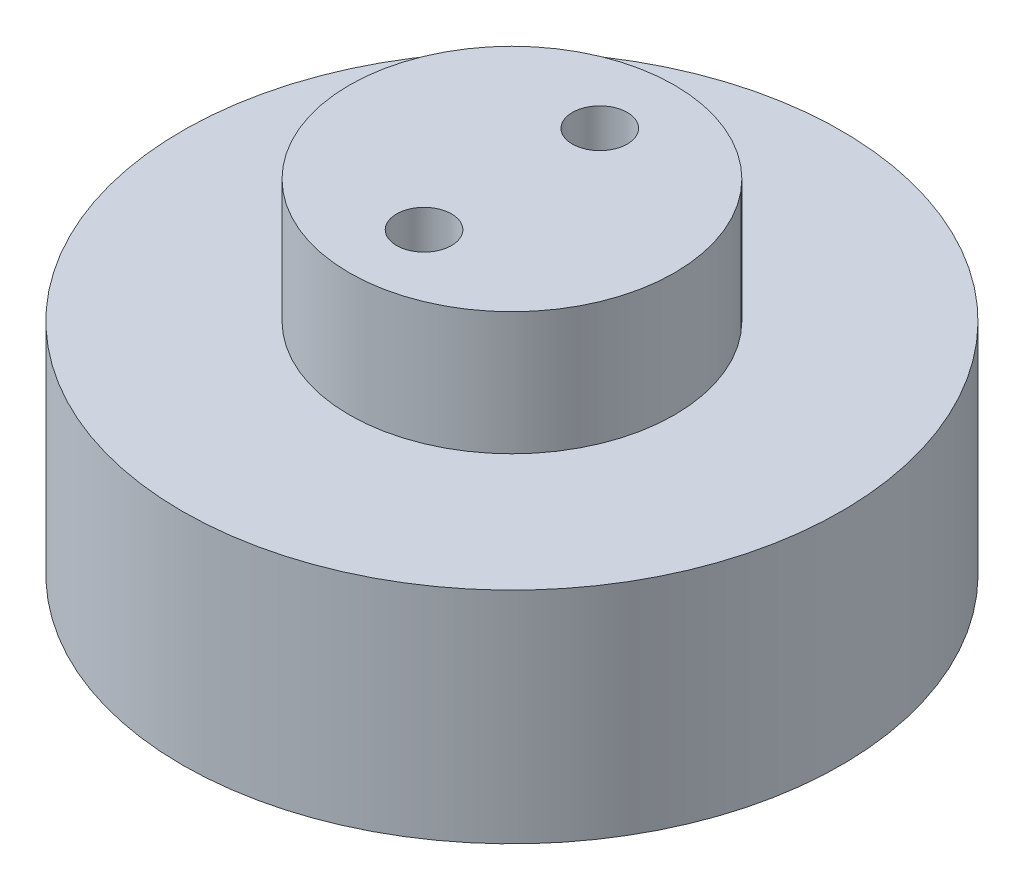
ISO-10303-21;
HEADER;
FILE_DESCRIPTION(('STEP AP214'),'2;1');
FILE_NAME('part.step','',(''),(''),'','','');
FILE_SCHEMA(('AUTOMOTIVE_DESIGN { 1 0 10303 214 1 1 1 1 }'));
ENDSEC;
DATA;
#1=APPLICATION_CONTEXT('core data for automotive mechanical design processes');
#2=APPLICATION_PROTOCOL_DEFINITION('international standard','automotive_design',2000,#1);
#3=PRODUCT_CONTEXT('',#1,'mechanical');
#4=PRODUCT('Part','Part','',(#3));
#5=PRODUCT_RELATED_PRODUCT_CATEGORY('part','',(#4));
#6=PRODUCT_DEFINITION_FORMATION('','',#4);
#7=PRODUCT_DEFINITION_CONTEXT('part definition',#1,'design');
#8=PRODUCT_DEFINITION('design','',#6,#7);
#9=PRODUCT_DEFINITION_SHAPE('','',#8);
#10=(LENGTH_UNIT() NAMED_UNIT(*) SI_UNIT(.MILLI.,.METRE.));
#11=(NAMED_UNIT(*) PLANE_ANGLE_UNIT() SI_UNIT($,.RADIAN.));
#12=(NAMED_UNIT(*) SI_UNIT($,.STERADIAN.) SOLID_ANGLE_UNIT());
#13=UNCERTAINTY_MEASURE_WITH_UNIT(LENGTH_MEASURE(1.E-05),#10,'distance_accuracy_value','');
#14=(GEOMETRIC_REPRESENTATION_CONTEXT(3) GLOBAL_UNCERTAINTY_ASSIGNED_CONTEXT((#13)) GLOBAL_UNIT_ASSIGNED_CONTEXT((#10,
#11,#12)) REPRESENTATION_CONTEXT('',''));
#15=CARTESIAN_POINT('',(0.,0.,0.));
#16=DIRECTION('',(0.,0.,1.));
#17=DIRECTION('',(1.,0.,0.));
#18=AXIS2_PLACEMENT_3D('',#15,#16,#17);
#19=CARTESIAN_POINT('',(0.,12.7,0.));
#20=DIRECTION('',(0.,-1.,0.));
#21=DIRECTION('',(0.,0.,-1.));
#22=AXIS2_PLACEMENT_3D('',#19,#20,#21);
#23=CYLINDRICAL_SURFACE('',#22,19.05);
#24=CARTESIAN_POINT('',(0.,12.7,0.));
#25=DIRECTION('',(0.,1.,0.));
#26=DIRECTION('',(0.,0.,1.));
#27=AXIS2_PLACEMENT_3D('',#24,#25,#26);
#28=CIRCLE('',#27,19.05);
#29=CARTESIAN_POINT('',(0.,12.7,19.05));
#30=VERTEX_POINT('',#29);
#31=EDGE_CURVE('E44',#30,#30,#28,.T.);
#32=ORIENTED_EDGE('',*,*,#31,.F.);
#33=EDGE_LOOP('',(#32));
#34=FACE_BOUND('',#33,.T.);
#35=CARTESIAN_POINT('',(0.,0.,0.));
#36=DIRECTION('',(0.,1.,0.));
#37=DIRECTION('',(0.,0.,1.));
#38=AXIS2_PLACEMENT_3D('',#35,#36,#37);
#39=CIRCLE('',#38,19.05);
#40=CARTESIAN_POINT('',(0.,0.,19.05));
#41=VERTEX_POINT('',#40);
#42=EDGE_CURVE('E231',#41,#41,#39,.T.);
#43=ORIENTED_EDGE('',*,*,#42,.T.);
#44=EDGE_LOOP('',(#43));
#45=FACE_BOUND('',#44,.T.);
#46=ADVANCED_FACE('F36',(#34,#45),#23,.T.);
#47=CARTESIAN_POINT('',(0.,12.7,0.));
#48=DIRECTION('',(0.,1.,0.));
#49=DIRECTION('',(0.,0.,1.));
#50=AXIS2_PLACEMENT_3D('',#47,#48,#49);
#51=PLANE('',#50);
#52=CARTESIAN_POINT('',(0.,12.7,0.));
#53=DIRECTION('',(0.,1.,0.));
#54=DIRECTION('',(0.,0.,1.));
#55=AXIS2_PLACEMENT_3D('',#52,#53,#54);
#56=CIRCLE('',#55,9.398);
#57=CARTESIAN_POINT('',(0.,12.7,9.398));
#58=VERTEX_POINT('',#57);
#59=EDGE_CURVE('E11',#58,#58,#56,.T.);
#60=ORIENTED_EDGE('',*,*,#59,.F.);
#61=EDGE_LOOP('',(#60));
#62=FACE_BOUND('',#61,.T.);
#63=ORIENTED_EDGE('',*,*,#31,.T.);
#64=EDGE_LOOP('',(#63));
#65=FACE_BOUND('',#64,.T.);
#66=ADVANCED_FACE('F299',(#62,#65),#51,.T.);
#67=CARTESIAN_POINT('',(0.,0.,0.));
#68=DIRECTION('',(0.,1.,0.));
#69=DIRECTION('',(0.,0.,1.));
#70=AXIS2_PLACEMENT_3D('',#67,#68,#69);
#71=PLANE('',#70);
#72=CARTESIAN_POINT('',(0.,0.,5.08));
#73=DIRECTION('',(0.,-1.,0.));
#74=DIRECTION('',(0.,0.,-1.));
#75=AXIS2_PLACEMENT_3D('',#72,#73,#74);
#76=CIRCLE('',#75,2.921);
#77=CARTESIAN_POINT('',(0.,0.,2.159));
#78=VERTEX_POINT('',#77);
#79=EDGE_CURVE('E255',#78,#78,#76,.T.);
#80=ORIENTED_EDGE('',*,*,#79,.F.);
#81=EDGE_LOOP('',(#80));
#82=FACE_BOUND('',#81,.T.);
#83=CARTESIAN_POINT('',(0.,0.,-5.08));
#84=DIRECTION('',(0.,-1.,0.));
#85=DIRECTION('',(0.,0.,-1.));
#86=AXIS2_PLACEMENT_3D('',#83,#84,#85);
#87=CIRCLE('',#86,2.921);
#88=CARTESIAN_POINT('',(0.,0.,-8.001));
#89=VERTEX_POINT('',#88);
#90=EDGE_CURVE('E248',#89,#89,#87,.T.);
#91=ORIENTED_EDGE('',*,*,#90,.F.);
#92=EDGE_LOOP('',(#91));
#93=FACE_BOUND('',#92,.T.);
#94=DIRECTION('',(-0.5,0.,0.866025403784439));
#95=VECTOR('',#94,1.);
#96=CARTESIAN_POINT('',(-5.39397352783964,0.,0.));
#97=LINE('',#96,#95);
#98=CARTESIAN_POINT('',(-5.39397352783965,0.,0.));
#99=VERTEX_POINT('',#98);
#100=CARTESIAN_POINT('',(-7.77698676391982,0.,4.1275));
#101=VERTEX_POINT('',#100);
#102=EDGE_CURVE('E164',#99,#101,#97,.T.);
#103=ORIENTED_EDGE('',*,*,#102,.F.);
#104=DIRECTION('',(0.5,0.,0.866025403784439));
#105=VECTOR('',#104,1.);
#106=CARTESIAN_POINT('',(-7.77698676391982,0.,-4.1275));
#107=LINE('',#106,#105);
#108=CARTESIAN_POINT('',(-7.77698676391982,0.,-4.1275));
#109=VERTEX_POINT('',#108);
#110=EDGE_CURVE('E52',#109,#99,#107,.T.);
#111=ORIENTED_EDGE('',*,*,#110,.F.);
#112=DIRECTION('',(1.,0.,0.));
#113=VECTOR('',#112,1.);
#114=CARTESIAN_POINT('',(-12.5430132360802,0.,-4.1275));
#115=LINE('',#114,#113);
#116=CARTESIAN_POINT('',(-12.5430132360802,0.,-4.1275));
#117=VERTEX_POINT('',#116);
#118=EDGE_CURVE('E147',#117,#109,#115,.T.);
#119=ORIENTED_EDGE('',*,*,#118,.F.);
#120=DIRECTION('',(0.5,0.,-0.866025403784439));
#121=VECTOR('',#120,1.);
#122=CARTESIAN_POINT('',(-14.9260264721604,0.,0.));
#123=LINE('',#122,#121);
#124=CARTESIAN_POINT('',(-14.9260264721604,0.,0.));
#125=VERTEX_POINT('',#124);
#126=EDGE_CURVE('E150',#125,#117,#123,.T.);
#127=ORIENTED_EDGE('',*,*,#126,.F.);
#128=DIRECTION('',(-0.5,0.,-0.866025403784439));
#129=VECTOR('',#128,1.);
#130=CARTESIAN_POINT('',(-12.5430132360802,0.,4.1275));
#131=LINE('',#130,#129);
#132=CARTESIAN_POINT('',(-12.5430132360802,0.,4.1275));
#133=VERTEX_POINT('',#132);
#134=EDGE_CURVE('E170',#133,#125,#131,.T.);
#135=ORIENTED_EDGE('',*,*,#134,.F.);
#136=DIRECTION('',(-1.,0.,0.));
#137=VECTOR('',#136,1.);
#138=CARTESIAN_POINT('',(-7.77698676391982,0.,4.1275));
#139=LINE('',#138,#137);
#140=EDGE_CURVE('E167',#101,#133,#139,.T.);
#141=ORIENTED_EDGE('',*,*,#140,.F.);
#142=EDGE_LOOP('',(#103,#111,#119,#127,#135,#141));
#143=FACE_BOUND('',#142,.T.);
#144=DIRECTION('',(-0.5,0.,0.866025403784439));
#145=VECTOR('',#144,1.);
#146=CARTESIAN_POINT('',(14.9260264721604,0.,0.));
#147=LINE('',#146,#145);
#148=CARTESIAN_POINT('',(14.9260264721604,0.,0.));
#149=VERTEX_POINT('',#148);
#150=CARTESIAN_POINT('',(12.5430132360802,0.,4.12750000000001));
#151=VERTEX_POINT('',#150);
#152=EDGE_CURVE('E206',#149,#151,#147,.T.);
#153=ORIENTED_EDGE('',*,*,#152,.F.);
#154=DIRECTION('',(0.499999999999999,0.,0.866025403784439));
#155=VECTOR('',#154,1.);
#156=CARTESIAN_POINT('',(12.5430132360802,0.,-4.1275));
#157=LINE('',#156,#155);
#158=CARTESIAN_POINT('',(12.5430132360802,0.,-4.1275));
#159=VERTEX_POINT('',#158);
#160=EDGE_CURVE('E60',#159,#149,#157,.T.);
#161=ORIENTED_EDGE('',*,*,#160,.F.);
#162=DIRECTION('',(1.,0.,0.));
#163=VECTOR('',#162,1.);
#164=CARTESIAN_POINT('',(7.77698676391982,0.,-4.1275));
#165=LINE('',#164,#163);
#166=CARTESIAN_POINT('',(7.77698676391982,0.,-4.1275));
#167=VERTEX_POINT('',#166);
#168=EDGE_CURVE('E189',#167,#159,#165,.T.);
#169=ORIENTED_EDGE('',*,*,#168,.F.);
#170=DIRECTION('',(0.5,0.,-0.866025403784439));
#171=VECTOR('',#170,1.);
#172=CARTESIAN_POINT('',(5.39397352783964,0.,0.));
#173=LINE('',#172,#171);
#174=CARTESIAN_POINT('',(5.39397352783964,0.,0.));
#175=VERTEX_POINT('',#174);
#176=EDGE_CURVE('E215',#175,#167,#173,.T.);
#177=ORIENTED_EDGE('',*,*,#176,.F.);
#178=DIRECTION('',(-0.5,0.,-0.866025403784439));
#179=VECTOR('',#178,1.);
#180=CARTESIAN_POINT('',(7.77698676391982,0.,4.12750000000001));
#181=LINE('',#180,#179);
#182=CARTESIAN_POINT('',(7.77698676391982,0.,4.12750000000001));
#183=VERTEX_POINT('',#182);
#184=EDGE_CURVE('E212',#183,#175,#181,.T.);
#185=ORIENTED_EDGE('',*,*,#184,.F.);
#186=DIRECTION('',(-1.,0.,0.));
#187=VECTOR('',#186,1.);
#188=CARTESIAN_POINT('',(12.5430132360802,0.,4.12750000000001));
#189=LINE('',#188,#187);
#190=EDGE_CURVE('E209',#151,#183,#189,.T.);
#191=ORIENTED_EDGE('',*,*,#190,.F.);
#192=EDGE_LOOP('',(#153,#161,#169,#177,#185,#191));
#193=FACE_BOUND('',#192,.T.);
#194=ORIENTED_EDGE('',*,*,#42,.F.);
#195=EDGE_LOOP('',(#194));
#196=FACE_BOUND('',#195,.T.);
#197=ADVANCED_FACE('F295',(#82,#93,#143,#193,#196),#71,.F.);
#198=CARTESIAN_POINT('',(0.,19.812,0.));
#199=DIRECTION('',(0.,-1.,0.));
#200=DIRECTION('',(0.,0.,-1.));
#201=AXIS2_PLACEMENT_3D('',#198,#199,#200);
#202=CYLINDRICAL_SURFACE('',#201,9.398);
#203=CARTESIAN_POINT('',(0.,19.812,0.));
#204=DIRECTION('',(0.,1.,0.));
#205=DIRECTION('',(0.,0.,1.));
#206=AXIS2_PLACEMENT_3D('',#203,#204,#205);
#207=CIRCLE('',#206,9.398);
#208=CARTESIAN_POINT('',(0.,19.812,9.398));
#209=VERTEX_POINT('',#208);
#210=EDGE_CURVE('E177',#209,#209,#207,.T.);
#211=ORIENTED_EDGE('',*,*,#210,.F.);
#212=EDGE_LOOP('',(#211));
#213=FACE_BOUND('',#212,.T.);
#214=ORIENTED_EDGE('',*,*,#59,.T.);
#215=EDGE_LOOP('',(#214));
#216=FACE_BOUND('',#215,.T.);
#217=ADVANCED_FACE('F298',(#213,#216),#202,.T.);
#218=CARTESIAN_POINT('',(0.,19.812,0.));
#219=DIRECTION('',(0.,1.,0.));
#220=DIRECTION('',(0.,0.,1.));
#221=AXIS2_PLACEMENT_3D('',#218,#219,#220);
#222=PLANE('',#221);
#223=CARTESIAN_POINT('',(0.,19.812,5.08));
#224=DIRECTION('',(0.,-1.,0.));
#225=DIRECTION('',(0.,0.,-1.));
#226=AXIS2_PLACEMENT_3D('',#223,#224,#225);
#227=CIRCLE('',#226,1.5875);
#228=CARTESIAN_POINT('',(0.,19.812,3.4925));
#229=VERTEX_POINT('',#228);
#230=EDGE_CURVE('E252',#229,#229,#227,.T.);
#231=ORIENTED_EDGE('',*,*,#230,.T.);
#232=EDGE_LOOP('',(#231));
#233=FACE_BOUND('',#232,.T.);
#234=CARTESIAN_POINT('',(0.,19.812,-5.08));
#235=DIRECTION('',(0.,-1.,0.));
#236=DIRECTION('',(0.,0.,-1.));
#237=AXIS2_PLACEMENT_3D('',#234,#235,#236);
#238=CIRCLE('',#237,1.5875);
#239=CARTESIAN_POINT('',(0.,19.812,-6.6675));
#240=VERTEX_POINT('',#239);
#241=EDGE_CURVE('E263',#240,#240,#238,.T.);
#242=ORIENTED_EDGE('',*,*,#241,.T.);
#243=EDGE_LOOP('',(#242));
#244=FACE_BOUND('',#243,.T.);
#245=ORIENTED_EDGE('',*,*,#210,.T.);
#246=EDGE_LOOP('',(#245));
#247=FACE_BOUND('',#246,.T.);
#248=ADVANCED_FACE('F272',(#233,#244,#247),#222,.T.);
#249=CARTESIAN_POINT('',(12.5430132360802,3.175,-4.1275));
#250=DIRECTION('',(0.866025403784439,0.,-0.499999999999999));
#251=DIRECTION('',(-0.499999999999999,0.,-0.866025403784439));
#252=AXIS2_PLACEMENT_3D('',#249,#250,#251);
#253=PLANE('',#252);
#254=ORIENTED_EDGE('',*,*,#160,.T.);
#255=DIRECTION('',(0.,-1.,0.));
#256=VECTOR('',#255,1.);
#257=CARTESIAN_POINT('',(14.9260264721604,3.175,0.));
#258=LINE('',#257,#256);
#259=CARTESIAN_POINT('',(14.9260264721604,3.175,0.));
#260=VERTEX_POINT('',#259);
#261=EDGE_CURVE('E204',#260,#149,#258,.T.);
#262=ORIENTED_EDGE('',*,*,#261,.F.);
#263=DIRECTION('',(0.499999999999999,0.,0.866025403784439));
#264=VECTOR('',#263,1.);
#265=CARTESIAN_POINT('',(12.5430132360802,3.175,-4.1275));
#266=LINE('',#265,#264);
#267=CARTESIAN_POINT('',(12.5430132360802,3.175,-4.1275));
#268=VERTEX_POINT('',#267);
#269=EDGE_CURVE('E185',#268,#260,#266,.T.);
#270=ORIENTED_EDGE('',*,*,#269,.F.);
#271=DIRECTION('',(0.,-1.,0.));
#272=VECTOR('',#271,1.);
#273=CARTESIAN_POINT('',(12.5430132360802,3.175,-4.1275));
#274=LINE('',#273,#272);
#275=EDGE_CURVE('E165',#268,#159,#274,.T.);
#276=ORIENTED_EDGE('',*,*,#275,.T.);
#277=EDGE_LOOP('',(#254,#262,#270,#276));
#278=FACE_BOUND('',#277,.T.);
#279=ADVANCED_FACE('F327',(#278),#253,.F.);
#280=CARTESIAN_POINT('',(7.77698676391982,3.175,-4.1275));
#281=DIRECTION('',(0.,0.,-1.));
#282=DIRECTION('',(-1.,0.,0.));
#283=AXIS2_PLACEMENT_3D('',#280,#281,#282);
#284=PLANE('',#283);
#285=ORIENTED_EDGE('',*,*,#168,.T.);
#286=ORIENTED_EDGE('',*,*,#275,.F.);
#287=DIRECTION('',(1.,0.,0.));
#288=VECTOR('',#287,1.);
#289=CARTESIAN_POINT('',(7.77698676391982,3.175,-4.1275));
#290=LINE('',#289,#288);
#291=CARTESIAN_POINT('',(7.77698676391982,3.175,-4.1275));
#292=VERTEX_POINT('',#291);
#293=EDGE_CURVE('E201',#292,#268,#290,.T.);
#294=ORIENTED_EDGE('',*,*,#293,.F.);
#295=DIRECTION('',(0.,-1.,0.));
#296=VECTOR('',#295,1.);
#297=CARTESIAN_POINT('',(7.77698676391982,3.175,-4.1275));
#298=LINE('',#297,#296);
#299=EDGE_CURVE('E221',#292,#167,#298,.T.);
#300=ORIENTED_EDGE('',*,*,#299,.T.);
#301=EDGE_LOOP('',(#285,#286,#294,#300));
#302=FACE_BOUND('',#301,.T.);
#303=ADVANCED_FACE('F330',(#302),#284,.F.);
#304=CARTESIAN_POINT('',(5.39397352783964,3.175,0.));
#305=DIRECTION('',(-0.866025403784439,0.,-0.5));
#306=DIRECTION('',(-0.5,0.,0.866025403784439));
#307=AXIS2_PLACEMENT_3D('',#304,#305,#306);
#308=PLANE('',#307);
#309=ORIENTED_EDGE('',*,*,#176,.T.);
#310=ORIENTED_EDGE('',*,*,#299,.F.);
#311=DIRECTION('',(0.5,0.,-0.866025403784439));
#312=VECTOR('',#311,1.);
#313=CARTESIAN_POINT('',(5.39397352783964,3.175,0.));
#314=LINE('',#313,#312);
#315=CARTESIAN_POINT('',(5.39397352783964,3.175,0.));
#316=VERTEX_POINT('',#315);
#317=EDGE_CURVE('E198',#316,#292,#314,.T.);
#318=ORIENTED_EDGE('',*,*,#317,.F.);
#319=DIRECTION('',(0.,-1.,0.));
#320=VECTOR('',#319,1.);
#321=CARTESIAN_POINT('',(5.39397352783964,3.175,0.));
#322=LINE('',#321,#320);
#323=EDGE_CURVE('E223',#316,#175,#322,.T.);
#324=ORIENTED_EDGE('',*,*,#323,.T.);
#325=EDGE_LOOP('',(#309,#310,#318,#324));
#326=FACE_BOUND('',#325,.T.);
#327=ADVANCED_FACE('F343',(#326),#308,.F.);
#328=CARTESIAN_POINT('',(7.77698676391982,3.175,4.12750000000001));
#329=DIRECTION('',(-0.866025403784439,0.,0.5));
#330=DIRECTION('',(0.5,0.,0.866025403784439));
#331=AXIS2_PLACEMENT_3D('',#328,#329,#330);
#332=PLANE('',#331);
#333=ORIENTED_EDGE('',*,*,#184,.T.);
#334=ORIENTED_EDGE('',*,*,#323,.F.);
#335=DIRECTION('',(-0.5,0.,-0.866025403784439));
#336=VECTOR('',#335,1.);
#337=CARTESIAN_POINT('',(7.77698676391982,3.175,4.12750000000001));
#338=LINE('',#337,#336);
#339=CARTESIAN_POINT('',(7.77698676391982,3.175,4.12750000000001));
#340=VERTEX_POINT('',#339);
#341=EDGE_CURVE('E195',#340,#316,#338,.T.);
#342=ORIENTED_EDGE('',*,*,#341,.F.);
#343=DIRECTION('',(0.,-1.,0.));
#344=VECTOR('',#343,1.);
#345=CARTESIAN_POINT('',(7.77698676391982,3.175,4.12750000000001));
#346=LINE('',#345,#344);
#347=EDGE_CURVE('E225',#340,#183,#346,.T.);
#348=ORIENTED_EDGE('',*,*,#347,.T.);
#349=EDGE_LOOP('',(#333,#334,#342,#348));
#350=FACE_BOUND('',#349,.T.);
#351=ADVANCED_FACE('F339',(#350),#332,.F.);
#352=CARTESIAN_POINT('',(12.5430132360802,3.175,4.12750000000001));
#353=DIRECTION('',(0.,0.,1.));
#354=DIRECTION('',(1.,0.,0.));
#355=AXIS2_PLACEMENT_3D('',#352,#353,#354);
#356=PLANE('',#355);
#357=ORIENTED_EDGE('',*,*,#190,.T.);
#358=ORIENTED_EDGE('',*,*,#347,.F.);
#359=DIRECTION('',(-1.,0.,0.));
#360=VECTOR('',#359,1.);
#361=CARTESIAN_POINT('',(12.5430132360802,3.175,4.12750000000001));
#362=LINE('',#361,#360);
#363=CARTESIAN_POINT('',(12.5430132360802,3.175,4.12750000000001));
#364=VERTEX_POINT('',#363);
#365=EDGE_CURVE('E192',#364,#340,#362,.T.);
#366=ORIENTED_EDGE('',*,*,#365,.F.);
#367=DIRECTION('',(0.,-1.,0.));
#368=VECTOR('',#367,1.);
#369=CARTESIAN_POINT('',(12.5430132360802,3.175,4.12750000000001));
#370=LINE('',#369,#368);
#371=EDGE_CURVE('E227',#364,#151,#370,.T.);
#372=ORIENTED_EDGE('',*,*,#371,.T.);
#373=EDGE_LOOP('',(#357,#358,#366,#372));
#374=FACE_BOUND('',#373,.T.);
#375=ADVANCED_FACE('F335',(#374),#356,.F.);
#376=CARTESIAN_POINT('',(14.9260264721604,3.175,0.));
#377=DIRECTION('',(0.866025403784439,0.,0.5));
#378=DIRECTION('',(0.5,0.,-0.866025403784439));
#379=AXIS2_PLACEMENT_3D('',#376,#377,#378);
#380=PLANE('',#379);
#381=ORIENTED_EDGE('',*,*,#152,.T.);
#382=ORIENTED_EDGE('',*,*,#371,.F.);
#383=DIRECTION('',(-0.5,0.,0.866025403784439));
#384=VECTOR('',#383,1.);
#385=CARTESIAN_POINT('',(14.9260264721604,3.175,0.));
#386=LINE('',#385,#384);
#387=EDGE_CURVE('E188',#260,#364,#386,.T.);
#388=ORIENTED_EDGE('',*,*,#387,.F.);
#389=ORIENTED_EDGE('',*,*,#261,.T.);
#390=EDGE_LOOP('',(#381,#382,#388,#389));
#391=FACE_BOUND('',#390,.T.);
#392=ADVANCED_FACE('F331',(#391),#380,.F.);
#393=CARTESIAN_POINT('',(0.,3.175,0.));
#394=DIRECTION('',(0.,-1.,0.));
#395=DIRECTION('',(0.,0.,-1.));
#396=AXIS2_PLACEMENT_3D('',#393,#394,#395);
#397=PLANE('',#396);
#398=CARTESIAN_POINT('',(10.16,3.175,0.));
#399=DIRECTION('',(0.,-1.,0.));
#400=DIRECTION('',(0.,0.,-1.));
#401=AXIS2_PLACEMENT_3D('',#398,#399,#400);
#402=CIRCLE('',#401,1.5875);
#403=CARTESIAN_POINT('',(10.16,3.175,-1.5875));
#404=VERTEX_POINT('',#403);
#405=EDGE_CURVE('E39',#404,#404,#402,.T.);
#406=ORIENTED_EDGE('',*,*,#405,.F.);
#407=EDGE_LOOP('',(#406));
#408=FACE_BOUND('',#407,.T.);
#409=ORIENTED_EDGE('',*,*,#269,.T.);
#410=ORIENTED_EDGE('',*,*,#387,.T.);
#411=ORIENTED_EDGE('',*,*,#365,.T.);
#412=ORIENTED_EDGE('',*,*,#341,.T.);
#413=ORIENTED_EDGE('',*,*,#317,.T.);
#414=ORIENTED_EDGE('',*,*,#293,.T.);
#415=EDGE_LOOP('',(#409,#410,#411,#412,#413,#414));
#416=FACE_BOUND('',#415,.T.);
#417=ADVANCED_FACE('F334',(#408,#416),#397,.T.);
#418=CARTESIAN_POINT('',(-7.77698676391982,3.175,-4.1275));
#419=DIRECTION('',(0.866025403784439,0.,-0.5));
#420=DIRECTION('',(-0.5,0.,-0.866025403784439));
#421=AXIS2_PLACEMENT_3D('',#418,#419,#420);
#422=PLANE('',#421);
#423=ORIENTED_EDGE('',*,*,#110,.T.);
#424=DIRECTION('',(0.,-1.,0.));
#425=VECTOR('',#424,1.);
#426=CARTESIAN_POINT('',(-5.39397352783964,3.175,0.));
#427=LINE('',#426,#425);
#428=CARTESIAN_POINT('',(-5.39397352783964,3.175,0.));
#429=VERTEX_POINT('',#428);
#430=EDGE_CURVE('E124',#429,#99,#427,.T.);
#431=ORIENTED_EDGE('',*,*,#430,.F.);
#432=DIRECTION('',(0.5,0.,0.866025403784439));
#433=VECTOR('',#432,1.);
#434=CARTESIAN_POINT('',(-7.77698676391982,3.175,-4.1275));
#435=LINE('',#434,#433);
#436=CARTESIAN_POINT('',(-7.77698676391982,3.175,-4.1275));
#437=VERTEX_POINT('',#436);
#438=EDGE_CURVE('E128',#437,#429,#435,.T.);
#439=ORIENTED_EDGE('',*,*,#438,.F.);
#440=DIRECTION('',(0.,-1.,0.));
#441=VECTOR('',#440,1.);
#442=CARTESIAN_POINT('',(-7.77698676391982,3.175,-4.1275));
#443=LINE('',#442,#441);
#444=EDGE_CURVE('E175',#437,#109,#443,.T.);
#445=ORIENTED_EDGE('',*,*,#444,.T.);
#446=EDGE_LOOP('',(#423,#431,#439,#445));
#447=FACE_BOUND('',#446,.T.);
#448=ADVANCED_FACE('F126',(#447),#422,.F.);
#449=CARTESIAN_POINT('',(-12.5430132360802,3.175,-4.1275));
#450=DIRECTION('',(0.,0.,-1.));
#451=DIRECTION('',(-1.,0.,0.));
#452=AXIS2_PLACEMENT_3D('',#449,#450,#451);
#453=PLANE('',#452);
#454=ORIENTED_EDGE('',*,*,#118,.T.);
#455=ORIENTED_EDGE('',*,*,#444,.F.);
#456=DIRECTION('',(1.,0.,0.));
#457=VECTOR('',#456,1.);
#458=CARTESIAN_POINT('',(-12.5430132360802,3.175,-4.1275));
#459=LINE('',#458,#457);
#460=CARTESIAN_POINT('',(-12.5430132360802,3.175,-4.1275));
#461=VERTEX_POINT('',#460);
#462=EDGE_CURVE('E134',#461,#437,#459,.T.);
#463=ORIENTED_EDGE('',*,*,#462,.F.);
#464=DIRECTION('',(0.,-1.,0.));
#465=VECTOR('',#464,1.);
#466=CARTESIAN_POINT('',(-12.5430132360802,3.175,-4.1275));
#467=LINE('',#466,#465);
#468=EDGE_CURVE('E178',#461,#117,#467,.T.);
#469=ORIENTED_EDGE('',*,*,#468,.T.);
#470=EDGE_LOOP('',(#454,#455,#463,#469));
#471=FACE_BOUND('',#470,.T.);
#472=ADVANCED_FACE('F356',(#471),#453,.F.);
#473=CARTESIAN_POINT('',(-14.9260264721604,3.175,0.));
#474=DIRECTION('',(-0.866025403784439,0.,-0.5));
#475=DIRECTION('',(-0.5,0.,0.866025403784439));
#476=AXIS2_PLACEMENT_3D('',#473,#474,#475);
#477=PLANE('',#476);
#478=ORIENTED_EDGE('',*,*,#126,.T.);
#479=ORIENTED_EDGE('',*,*,#468,.F.);
#480=DIRECTION('',(0.5,0.,-0.866025403784439));
#481=VECTOR('',#480,1.);
#482=CARTESIAN_POINT('',(-14.9260264721604,3.175,0.));
#483=LINE('',#482,#481);
#484=CARTESIAN_POINT('',(-14.9260264721604,3.175,0.));
#485=VERTEX_POINT('',#484);
#486=EDGE_CURVE('E160',#485,#461,#483,.T.);
#487=ORIENTED_EDGE('',*,*,#486,.F.);
#488=DIRECTION('',(0.,-1.,0.));
#489=VECTOR('',#488,1.);
#490=CARTESIAN_POINT('',(-14.9260264721604,3.175,0.));
#491=LINE('',#490,#489);
#492=EDGE_CURVE('E180',#485,#125,#491,.T.);
#493=ORIENTED_EDGE('',*,*,#492,.T.);
#494=EDGE_LOOP('',(#478,#479,#487,#493));
#495=FACE_BOUND('',#494,.T.);
#496=ADVANCED_FACE('F366',(#495),#477,.F.);
#497=CARTESIAN_POINT('',(-12.5430132360802,3.175,4.1275));
#498=DIRECTION('',(-0.866025403784439,0.,0.5));
#499=DIRECTION('',(0.5,0.,0.866025403784439));
#500=AXIS2_PLACEMENT_3D('',#497,#498,#499);
#501=PLANE('',#500);
#502=ORIENTED_EDGE('',*,*,#134,.T.);
#503=ORIENTED_EDGE('',*,*,#492,.F.);
#504=DIRECTION('',(-0.5,0.,-0.866025403784439));
#505=VECTOR('',#504,1.);
#506=CARTESIAN_POINT('',(-12.5430132360802,3.175,4.1275));
#507=LINE('',#506,#505);
#508=CARTESIAN_POINT('',(-12.5430132360802,3.175,4.1275));
#509=VERTEX_POINT('',#508);
#510=EDGE_CURVE('E157',#509,#485,#507,.T.);
#511=ORIENTED_EDGE('',*,*,#510,.F.);
#512=DIRECTION('',(0.,-1.,0.));
#513=VECTOR('',#512,1.);
#514=CARTESIAN_POINT('',(-12.5430132360802,3.175,4.1275));
#515=LINE('',#514,#513);
#516=EDGE_CURVE('E182',#509,#133,#515,.T.);
#517=ORIENTED_EDGE('',*,*,#516,.T.);
#518=EDGE_LOOP('',(#502,#503,#511,#517));
#519=FACE_BOUND('',#518,.T.);
#520=ADVANCED_FACE('F362',(#519),#501,.F.);
#521=CARTESIAN_POINT('',(-7.77698676391982,3.175,4.1275));
#522=DIRECTION('',(0.,0.,1.));
#523=DIRECTION('',(1.,0.,0.));
#524=AXIS2_PLACEMENT_3D('',#521,#522,#523);
#525=PLANE('',#524);
#526=ORIENTED_EDGE('',*,*,#140,.T.);
#527=ORIENTED_EDGE('',*,*,#516,.F.);
#528=DIRECTION('',(-1.,0.,0.));
#529=VECTOR('',#528,1.);
#530=CARTESIAN_POINT('',(-7.77698676391982,3.175,4.1275));
#531=LINE('',#530,#529);
#532=CARTESIAN_POINT('',(-7.77698676391982,3.175,4.1275));
#533=VERTEX_POINT('',#532);
#534=EDGE_CURVE('E142',#533,#509,#531,.T.);
#535=ORIENTED_EDGE('',*,*,#534,.F.);
#536=DIRECTION('',(0.,-1.,0.));
#537=VECTOR('',#536,1.);
#538=CARTESIAN_POINT('',(-7.77698676391982,3.175,4.1275));
#539=LINE('',#538,#537);
#540=EDGE_CURVE('E133',#533,#101,#539,.T.);
#541=ORIENTED_EDGE('',*,*,#540,.T.);
#542=EDGE_LOOP('',(#526,#527,#535,#541));
#543=FACE_BOUND('',#542,.T.);
#544=ADVANCED_FACE('F359',(#543),#525,.F.);
#545=CARTESIAN_POINT('',(-5.39397352783964,3.175,0.));
#546=DIRECTION('',(0.866025403784439,0.,0.5));
#547=DIRECTION('',(0.5,0.,-0.866025403784439));
#548=AXIS2_PLACEMENT_3D('',#545,#546,#547);
#549=PLANE('',#548);
#550=ORIENTED_EDGE('',*,*,#102,.T.);
#551=ORIENTED_EDGE('',*,*,#540,.F.);
#552=DIRECTION('',(-0.5,0.,0.866025403784439));
#553=VECTOR('',#552,1.);
#554=CARTESIAN_POINT('',(-5.39397352783964,3.175,0.));
#555=LINE('',#554,#553);
#556=EDGE_CURVE('E137',#429,#533,#555,.T.);
#557=ORIENTED_EDGE('',*,*,#556,.F.);
#558=ORIENTED_EDGE('',*,*,#430,.T.);
#559=EDGE_LOOP('',(#550,#551,#557,#558));
#560=FACE_BOUND('',#559,.T.);
#561=ADVANCED_FACE('F138',(#560),#549,.F.);
#562=CARTESIAN_POINT('',(0.,3.175,0.));
#563=DIRECTION('',(0.,-1.,0.));
#564=DIRECTION('',(0.,0.,-1.));
#565=AXIS2_PLACEMENT_3D('',#562,#563,#564);
#566=PLANE('',#565);
#567=CARTESIAN_POINT('',(-10.16,3.175,0.));
#568=DIRECTION('',(0.,-1.,0.));
#569=DIRECTION('',(0.,0.,-1.));
#570=AXIS2_PLACEMENT_3D('',#567,#568,#569);
#571=CIRCLE('',#570,1.5875);
#572=CARTESIAN_POINT('',(-10.16,3.175,-1.5875));
#573=VERTEX_POINT('',#572);
#574=EDGE_CURVE('E236',#573,#573,#571,.T.);
#575=ORIENTED_EDGE('',*,*,#574,.F.);
#576=EDGE_LOOP('',(#575));
#577=FACE_BOUND('',#576,.T.);
#578=ORIENTED_EDGE('',*,*,#438,.T.);
#579=ORIENTED_EDGE('',*,*,#556,.T.);
#580=ORIENTED_EDGE('',*,*,#534,.T.);
#581=ORIENTED_EDGE('',*,*,#510,.T.);
#582=ORIENTED_EDGE('',*,*,#486,.T.);
#583=ORIENTED_EDGE('',*,*,#462,.T.);
#584=EDGE_LOOP('',(#578,#579,#580,#581,#582,#583));
#585=FACE_BOUND('',#584,.T.);
#586=ADVANCED_FACE('F144',(#577,#585),#566,.T.);
#587=CARTESIAN_POINT('',(-10.16,7.62,0.));
#588=DIRECTION('',(0.,-1.,0.));
#589=DIRECTION('',(0.,0.,-1.));
#590=AXIS2_PLACEMENT_3D('',#587,#588,#589);
#591=CYLINDRICAL_SURFACE('',#590,1.5875);
#592=ORIENTED_EDGE('',*,*,#574,.T.);
#593=EDGE_LOOP('',(#592));
#594=FACE_BOUND('',#593,.T.);
#595=CARTESIAN_POINT('',(-10.16,7.62,0.));
#596=DIRECTION('',(0.,-1.,0.));
#597=DIRECTION('',(0.,0.,-1.));
#598=AXIS2_PLACEMENT_3D('',#595,#596,#597);
#599=CIRCLE('',#598,1.5875);
#600=CARTESIAN_POINT('',(-10.16,7.62,-1.5875));
#601=VERTEX_POINT('',#600);
#602=EDGE_CURVE('E238',#601,#601,#599,.T.);
#603=ORIENTED_EDGE('',*,*,#602,.F.);
#604=EDGE_LOOP('',(#603));
#605=FACE_BOUND('',#604,.T.);
#606=ADVANCED_FACE('F376',(#594,#605),#591,.F.);
#607=CARTESIAN_POINT('',(-10.16,7.62,0.));
#608=DIRECTION('',(0.,-1.,0.));
#609=DIRECTION('',(0.,0.,-1.));
#610=AXIS2_PLACEMENT_3D('',#607,#608,#609);
#611=PLANE('',#610);
#612=ORIENTED_EDGE('',*,*,#602,.T.);
#613=EDGE_LOOP('',(#612));
#614=FACE_BOUND('',#613,.T.);
#615=ADVANCED_FACE('F382',(#614),#611,.T.);
#616=CARTESIAN_POINT('',(10.16,7.62,0.));
#617=DIRECTION('',(0.,-1.,0.));
#618=DIRECTION('',(0.,0.,-1.));
#619=AXIS2_PLACEMENT_3D('',#616,#617,#618);
#620=CYLINDRICAL_SURFACE('',#619,1.5875);
#621=ORIENTED_EDGE('',*,*,#405,.T.);
#622=EDGE_LOOP('',(#621));
#623=FACE_BOUND('',#622,.T.);
#624=CARTESIAN_POINT('',(10.16,7.62,0.));
#625=DIRECTION('',(0.,-1.,0.));
#626=DIRECTION('',(0.,0.,-1.));
#627=AXIS2_PLACEMENT_3D('',#624,#625,#626);
#628=CIRCLE('',#627,1.5875);
#629=CARTESIAN_POINT('',(10.16,7.62,-1.5875));
#630=VERTEX_POINT('',#629);
#631=EDGE_CURVE('E153',#630,#630,#628,.T.);
#632=ORIENTED_EDGE('',*,*,#631,.F.);
#633=EDGE_LOOP('',(#632));
#634=FACE_BOUND('',#633,.T.);
#635=ADVANCED_FACE('F378',(#623,#634),#620,.F.);
#636=CARTESIAN_POINT('',(10.16,7.62,0.));
#637=DIRECTION('',(0.,-1.,0.));
#638=DIRECTION('',(0.,0.,-1.));
#639=AXIS2_PLACEMENT_3D('',#636,#637,#638);
#640=PLANE('',#639);
#641=ORIENTED_EDGE('',*,*,#631,.T.);
#642=EDGE_LOOP('',(#641));
#643=FACE_BOUND('',#642,.T.);
#644=ADVANCED_FACE('F381',(#643),#640,.T.);
#645=CARTESIAN_POINT('',(0.,17.272,-5.08));
#646=DIRECTION('',(0.,-1.,0.));
#647=DIRECTION('',(0.,0.,-1.));
#648=AXIS2_PLACEMENT_3D('',#645,#646,#647);
#649=CYLINDRICAL_SURFACE('',#648,2.921);
#650=CARTESIAN_POINT('',(0.,17.272,-5.08));
#651=DIRECTION('',(0.,-1.,0.));
#652=DIRECTION('',(0.,0.,-1.));
#653=AXIS2_PLACEMENT_3D('',#650,#651,#652);
#654=CIRCLE('',#653,2.921);
#655=CARTESIAN_POINT('',(0.,17.272,-8.001));
#656=VERTEX_POINT('',#655);
#657=EDGE_CURVE('E251',#656,#656,#654,.T.);
#658=ORIENTED_EDGE('',*,*,#657,.F.);
#659=EDGE_LOOP('',(#658));
#660=FACE_BOUND('',#659,.T.);
#661=ORIENTED_EDGE('',*,*,#90,.T.);
#662=EDGE_LOOP('',(#661));
#663=FACE_BOUND('',#662,.T.);
#664=ADVANCED_FACE('F386',(#660,#663),#649,.F.);
#665=CARTESIAN_POINT('',(0.,17.272,-5.08));
#666=DIRECTION('',(0.,-1.,0.));
#667=DIRECTION('',(0.,0.,-1.));
#668=AXIS2_PLACEMENT_3D('',#665,#666,#667);
#669=PLANE('',#668);
#670=CARTESIAN_POINT('',(0.,17.272,-5.08));
#671=DIRECTION('',(0.,-1.,0.));
#672=DIRECTION('',(0.,0.,-1.));
#673=AXIS2_PLACEMENT_3D('',#670,#671,#672);
#674=CIRCLE('',#673,1.5875);
#675=CARTESIAN_POINT('',(0.,17.272,-6.6675));
#676=VERTEX_POINT('',#675);
#677=EDGE_CURVE('E260',#676,#676,#674,.T.);
#678=ORIENTED_EDGE('',*,*,#677,.F.);
#679=EDGE_LOOP('',(#678));
#680=FACE_BOUND('',#679,.T.);
#681=ORIENTED_EDGE('',*,*,#657,.T.);
#682=EDGE_LOOP('',(#681));
#683=FACE_BOUND('',#682,.T.);
#684=ADVANCED_FACE('F291',(#680,#683),#669,.T.);
#685=CARTESIAN_POINT('',(0.,17.272,5.08));
#686=DIRECTION('',(0.,-1.,0.));
#687=DIRECTION('',(0.,0.,-1.));
#688=AXIS2_PLACEMENT_3D('',#685,#686,#687);
#689=CYLINDRICAL_SURFACE('',#688,2.921);
#690=CARTESIAN_POINT('',(0.,17.272,5.08));
#691=DIRECTION('',(0.,-1.,0.));
#692=DIRECTION('',(0.,0.,-1.));
#693=AXIS2_PLACEMENT_3D('',#690,#691,#692);
#694=CIRCLE('',#693,2.921);
#695=CARTESIAN_POINT('',(0.,17.272,2.159));
#696=VERTEX_POINT('',#695);
#697=EDGE_CURVE('E246',#696,#696,#694,.T.);
#698=ORIENTED_EDGE('',*,*,#697,.F.);
#699=EDGE_LOOP('',(#698));
#700=FACE_BOUND('',#699,.T.);
#701=ORIENTED_EDGE('',*,*,#79,.T.);
#702=EDGE_LOOP('',(#701));
#703=FACE_BOUND('',#702,.T.);
#704=ADVANCED_FACE('F285',(#700,#703),#689,.F.);
#705=CARTESIAN_POINT('',(0.,17.272,5.08));
#706=DIRECTION('',(0.,-1.,0.));
#707=DIRECTION('',(0.,0.,-1.));
#708=AXIS2_PLACEMENT_3D('',#705,#706,#707);
#709=PLANE('',#708);
#710=CARTESIAN_POINT('',(0.,17.272,5.08));
#711=DIRECTION('',(0.,-1.,0.));
#712=DIRECTION('',(0.,0.,-1.));
#713=AXIS2_PLACEMENT_3D('',#710,#711,#712);
#714=CIRCLE('',#713,1.5875);
#715=CARTESIAN_POINT('',(0.,17.272,3.4925));
#716=VERTEX_POINT('',#715);
#717=EDGE_CURVE('E266',#716,#716,#714,.T.);
#718=ORIENTED_EDGE('',*,*,#717,.F.);
#719=EDGE_LOOP('',(#718));
#720=FACE_BOUND('',#719,.T.);
#721=ORIENTED_EDGE('',*,*,#697,.T.);
#722=EDGE_LOOP('',(#721));
#723=FACE_BOUND('',#722,.T.);
#724=ADVANCED_FACE('F282',(#720,#723),#709,.T.);
#725=CARTESIAN_POINT('',(0.,19.812,-5.08));
#726=DIRECTION('',(0.,-1.,0.));
#727=DIRECTION('',(0.,0.,-1.));
#728=AXIS2_PLACEMENT_3D('',#725,#726,#727);
#729=CYLINDRICAL_SURFACE('',#728,1.5875);
#730=ORIENTED_EDGE('',*,*,#241,.F.);
#731=EDGE_LOOP('',(#730));
#732=FACE_BOUND('',#731,.T.);
#733=ORIENTED_EDGE('',*,*,#677,.T.);
#734=EDGE_LOOP('',(#733));
#735=FACE_BOUND('',#734,.T.);
#736=ADVANCED_FACE('F278',(#732,#735),#729,.F.);
#737=CARTESIAN_POINT('',(0.,19.812,5.08));
#738=DIRECTION('',(0.,-1.,0.));
#739=DIRECTION('',(0.,0.,-1.));
#740=AXIS2_PLACEMENT_3D('',#737,#738,#739);
#741=CYLINDRICAL_SURFACE('',#740,1.5875);
#742=ORIENTED_EDGE('',*,*,#230,.F.);
#743=EDGE_LOOP('',(#742));
#744=FACE_BOUND('',#743,.T.);
#745=ORIENTED_EDGE('',*,*,#717,.T.);
#746=EDGE_LOOP('',(#745));
#747=FACE_BOUND('',#746,.T.);
#748=ADVANCED_FACE('F275',(#744,#747),#741,.F.);
#749=CLOSED_SHELL('',(#46,#66,#197,#217,#248,#279,#303,#327,#351,#375,#392,#417,#448,#472,#496,
#520,#544,#561,#586,#606,#615,#635,#644,#664,#684,#704,#724,#736,#748));
#750=MANIFOLD_SOLID_BREP('B2',#749);
#751=ADVANCED_BREP_SHAPE_REPRESENTATION('',(#18,#750),#14);
#752=SHAPE_DEFINITION_REPRESENTATION(#9,#751);
ENDSEC;
END-ISO-10303-21;
